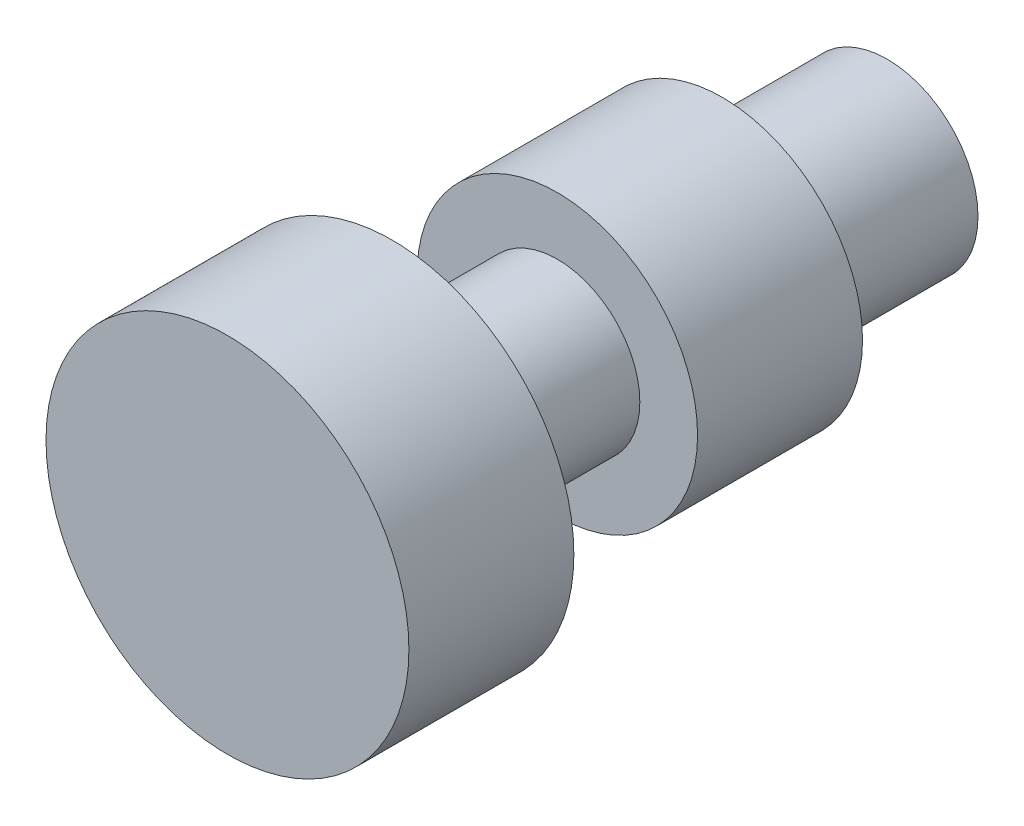
ISO-10303-21;
HEADER;
FILE_DESCRIPTION(('STEP AP214'),'2;1');
FILE_NAME('part.step','',(''),(''),'','','');
FILE_SCHEMA(('AUTOMOTIVE_DESIGN { 1 0 10303 214 1 1 1 1 }'));
ENDSEC;
DATA;
#1=APPLICATION_CONTEXT('core data for automotive mechanical design processes');
#2=APPLICATION_PROTOCOL_DEFINITION('international standard','automotive_design',2000,#1);
#3=PRODUCT_CONTEXT('',#1,'mechanical');
#4=PRODUCT('Part','Part','',(#3));
#5=PRODUCT_RELATED_PRODUCT_CATEGORY('part','',(#4));
#6=PRODUCT_DEFINITION_FORMATION('','',#4);
#7=PRODUCT_DEFINITION_CONTEXT('part definition',#1,'design');
#8=PRODUCT_DEFINITION('design','',#6,#7);
#9=PRODUCT_DEFINITION_SHAPE('','',#8);
#10=(LENGTH_UNIT() NAMED_UNIT(*) SI_UNIT(.MILLI.,.METRE.));
#11=(NAMED_UNIT(*) PLANE_ANGLE_UNIT() SI_UNIT($,.RADIAN.));
#12=(NAMED_UNIT(*) SI_UNIT($,.STERADIAN.) SOLID_ANGLE_UNIT());
#13=UNCERTAINTY_MEASURE_WITH_UNIT(LENGTH_MEASURE(1.E-05),#10,'distance_accuracy_value','');
#14=(GEOMETRIC_REPRESENTATION_CONTEXT(3) GLOBAL_UNCERTAINTY_ASSIGNED_CONTEXT((#13)) GLOBAL_UNIT_ASSIGNED_CONTEXT((#10,
#11,#12)) REPRESENTATION_CONTEXT('',''));
#15=CARTESIAN_POINT('',(0.,0.,0.));
#16=DIRECTION('',(0.,0.,1.));
#17=DIRECTION('',(1.,0.,0.));
#18=AXIS2_PLACEMENT_3D('',#15,#16,#17);
#19=CARTESIAN_POINT('',(0.,0.,-100.));
#20=DIRECTION('',(0.,0.,1.));
#21=DIRECTION('',(1.,0.,0.));
#22=AXIS2_PLACEMENT_3D('',#19,#20,#21);
#23=PLANE('',#22);
#24=CARTESIAN_POINT('',(0.,0.,-100.));
#25=DIRECTION('',(0.,0.,1.));
#26=DIRECTION('',(1.,0.,0.));
#27=AXIS2_PLACEMENT_3D('',#24,#25,#26);
#28=CIRCLE('',#27,27.5);
#29=CARTESIAN_POINT('',(27.5,0.,-100.));
#30=VERTEX_POINT('',#29);
#31=EDGE_CURVE('E10',#30,#30,#28,.T.);
#32=ORIENTED_EDGE('',*,*,#31,.F.);
#33=EDGE_LOOP('',(#32));
#34=FACE_BOUND('',#33,.T.);
#35=ADVANCED_FACE('F33',(#34),#23,.F.);
#36=CARTESIAN_POINT('',(0.,0.,100.));
#37=DIRECTION('',(0.,0.,1.));
#38=DIRECTION('',(1.,0.,0.));
#39=AXIS2_PLACEMENT_3D('',#36,#37,#38);
#40=CYLINDRICAL_SURFACE('',#39,27.5);
#41=CARTESIAN_POINT('',(0.,0.,-50.));
#42=DIRECTION('',(0.,0.,1.));
#43=DIRECTION('',(1.,0.,0.));
#44=AXIS2_PLACEMENT_3D('',#41,#42,#43);
#45=CIRCLE('',#44,27.5);
#46=CARTESIAN_POINT('',(27.5,0.,-50.));
#47=VERTEX_POINT('',#46);
#48=EDGE_CURVE('E39',#47,#47,#45,.T.);
#49=ORIENTED_EDGE('',*,*,#48,.F.);
#50=EDGE_LOOP('',(#49));
#51=FACE_BOUND('',#50,.T.);
#52=ORIENTED_EDGE('',*,*,#31,.T.);
#53=EDGE_LOOP('',(#52));
#54=FACE_BOUND('',#53,.T.);
#55=ADVANCED_FACE('F99',(#51,#54),#40,.T.);
#56=CARTESIAN_POINT('',(-27.5,0.,-50.));
#57=DIRECTION('',(0.,0.,1.));
#58=DIRECTION('',(1.,0.,0.));
#59=AXIS2_PLACEMENT_3D('',#56,#57,#58);
#60=PLANE('',#59);
#61=CARTESIAN_POINT('',(0.,0.,-50.));
#62=DIRECTION('',(0.,0.,1.));
#63=DIRECTION('',(1.,0.,0.));
#64=AXIS2_PLACEMENT_3D('',#61,#62,#63);
#65=CIRCLE('',#64,42.5);
#66=CARTESIAN_POINT('',(42.5,0.,-50.));
#67=VERTEX_POINT('',#66);
#68=EDGE_CURVE('E43',#67,#67,#65,.T.);
#69=ORIENTED_EDGE('',*,*,#68,.F.);
#70=EDGE_LOOP('',(#69));
#71=FACE_BOUND('',#70,.T.);
#72=ORIENTED_EDGE('',*,*,#48,.T.);
#73=EDGE_LOOP('',(#72));
#74=FACE_BOUND('',#73,.T.);
#75=ADVANCED_FACE('F94',(#71,#74),#60,.F.);
#76=CARTESIAN_POINT('',(0.,0.,100.));
#77=DIRECTION('',(0.,0.,1.));
#78=DIRECTION('',(1.,0.,0.));
#79=AXIS2_PLACEMENT_3D('',#76,#77,#78);
#80=CYLINDRICAL_SURFACE('',#79,42.5);
#81=CARTESIAN_POINT('',(0.,0.,0.));
#82=DIRECTION('',(0.,0.,1.));
#83=DIRECTION('',(1.,0.,0.));
#84=AXIS2_PLACEMENT_3D('',#81,#82,#83);
#85=CIRCLE('',#84,42.5);
#86=CARTESIAN_POINT('',(42.5,0.,0.));
#87=VERTEX_POINT('',#86);
#88=EDGE_CURVE('E47',#87,#87,#85,.T.);
#89=ORIENTED_EDGE('',*,*,#88,.F.);
#90=EDGE_LOOP('',(#89));
#91=FACE_BOUND('',#90,.T.);
#92=ORIENTED_EDGE('',*,*,#68,.T.);
#93=EDGE_LOOP('',(#92));
#94=FACE_BOUND('',#93,.T.);
#95=ADVANCED_FACE('F88',(#91,#94),#80,.T.);
#96=CARTESIAN_POINT('',(-42.5,0.,0.));
#97=DIRECTION('',(0.,0.,-1.));
#98=DIRECTION('',(-1.,0.,0.));
#99=AXIS2_PLACEMENT_3D('',#96,#97,#98);
#100=PLANE('',#99);
#101=CARTESIAN_POINT('',(0.,0.,0.));
#102=DIRECTION('',(0.,0.,1.));
#103=DIRECTION('',(1.,0.,0.));
#104=AXIS2_PLACEMENT_3D('',#101,#102,#103);
#105=CIRCLE('',#104,25.);
#106=CARTESIAN_POINT('',(25.,0.,0.));
#107=VERTEX_POINT('',#106);
#108=EDGE_CURVE('E52',#107,#107,#105,.T.);
#109=ORIENTED_EDGE('',*,*,#108,.F.);
#110=EDGE_LOOP('',(#109));
#111=FACE_BOUND('',#110,.T.);
#112=ORIENTED_EDGE('',*,*,#88,.T.);
#113=EDGE_LOOP('',(#112));
#114=FACE_BOUND('',#113,.T.);
#115=ADVANCED_FACE('F82',(#111,#114),#100,.F.);
#116=CARTESIAN_POINT('',(0.,0.,100.));
#117=DIRECTION('',(0.,0.,1.));
#118=DIRECTION('',(1.,0.,0.));
#119=AXIS2_PLACEMENT_3D('',#116,#117,#118);
#120=CYLINDRICAL_SURFACE('',#119,25.);
#121=CARTESIAN_POINT('',(0.,0.,50.));
#122=DIRECTION('',(0.,0.,1.));
#123=DIRECTION('',(1.,0.,0.));
#124=AXIS2_PLACEMENT_3D('',#121,#122,#123);
#125=CIRCLE('',#124,25.);
#126=CARTESIAN_POINT('',(25.,0.,50.));
#127=VERTEX_POINT('',#126);
#128=EDGE_CURVE('E55',#127,#127,#125,.T.);
#129=ORIENTED_EDGE('',*,*,#128,.F.);
#130=EDGE_LOOP('',(#129));
#131=FACE_BOUND('',#130,.T.);
#132=ORIENTED_EDGE('',*,*,#108,.T.);
#133=EDGE_LOOP('',(#132));
#134=FACE_BOUND('',#133,.T.);
#135=ADVANCED_FACE('F76',(#131,#134),#120,.T.);
#136=CARTESIAN_POINT('',(-25.,0.,50.));
#137=DIRECTION('',(0.,0.,1.));
#138=DIRECTION('',(1.,0.,0.));
#139=AXIS2_PLACEMENT_3D('',#136,#137,#138);
#140=PLANE('',#139);
#141=CARTESIAN_POINT('',(0.,0.,50.));
#142=DIRECTION('',(0.,0.,1.));
#143=DIRECTION('',(1.,0.,0.));
#144=AXIS2_PLACEMENT_3D('',#141,#142,#143);
#145=CIRCLE('',#144,55.);
#146=CARTESIAN_POINT('',(55.,0.,50.));
#147=VERTEX_POINT('',#146);
#148=EDGE_CURVE('E58',#147,#147,#145,.T.);
#149=ORIENTED_EDGE('',*,*,#148,.F.);
#150=EDGE_LOOP('',(#149));
#151=FACE_BOUND('',#150,.T.);
#152=ORIENTED_EDGE('',*,*,#128,.T.);
#153=EDGE_LOOP('',(#152));
#154=FACE_BOUND('',#153,.T.);
#155=ADVANCED_FACE('F70',(#151,#154),#140,.F.);
#156=CARTESIAN_POINT('',(0.,0.,100.));
#157=DIRECTION('',(0.,0.,1.));
#158=DIRECTION('',(1.,0.,0.));
#159=AXIS2_PLACEMENT_3D('',#156,#157,#158);
#160=CYLINDRICAL_SURFACE('',#159,55.);
#161=CARTESIAN_POINT('',(0.,0.,100.));
#162=DIRECTION('',(0.,0.,1.));
#163=DIRECTION('',(1.,0.,0.));
#164=AXIS2_PLACEMENT_3D('',#161,#162,#163);
#165=CIRCLE('',#164,55.);
#166=CARTESIAN_POINT('',(55.,0.,100.));
#167=VERTEX_POINT('',#166);
#168=EDGE_CURVE('E61',#167,#167,#165,.T.);
#169=ORIENTED_EDGE('',*,*,#168,.F.);
#170=EDGE_LOOP('',(#169));
#171=FACE_BOUND('',#170,.T.);
#172=ORIENTED_EDGE('',*,*,#148,.T.);
#173=EDGE_LOOP('',(#172));
#174=FACE_BOUND('',#173,.T.);
#175=ADVANCED_FACE('F67',(#171,#174),#160,.T.);
#176=CARTESIAN_POINT('',(-55.,0.,100.));
#177=DIRECTION('',(0.,0.,-1.));
#178=DIRECTION('',(-1.,0.,0.));
#179=AXIS2_PLACEMENT_3D('',#176,#177,#178);
#180=PLANE('',#179);
#181=ORIENTED_EDGE('',*,*,#168,.T.);
#182=EDGE_LOOP('',(#181));
#183=FACE_BOUND('',#182,.T.);
#184=ADVANCED_FACE('F65',(#183),#180,.F.);
#185=CLOSED_SHELL('',(#35,#55,#75,#95,#115,#135,#155,#175,#184));
#186=MANIFOLD_SOLID_BREP('B2',#185);
#187=ADVANCED_BREP_SHAPE_REPRESENTATION('',(#18,#186),#14);
#188=SHAPE_DEFINITION_REPRESENTATION(#9,#187);
ENDSEC;
END-ISO-10303-21;
